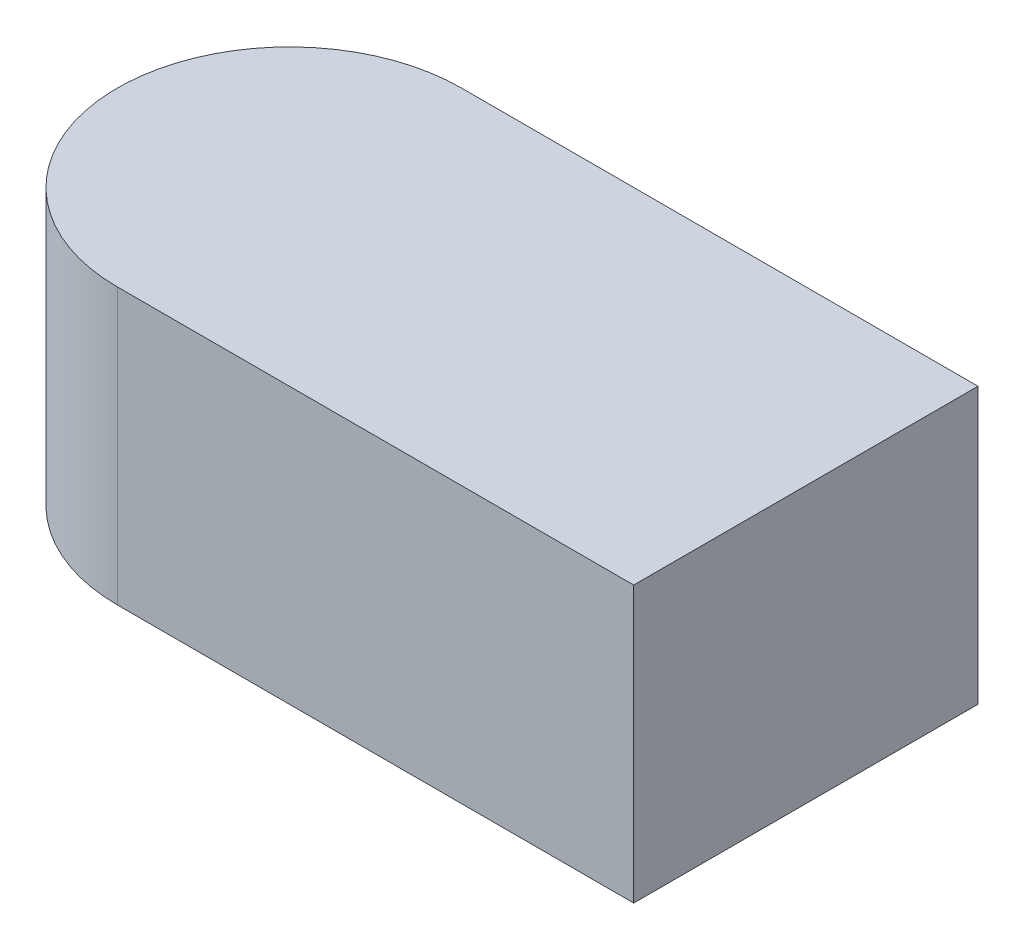
ISO-10303-21;
HEADER;
FILE_DESCRIPTION(('STEP AP214'),'2;1');
FILE_NAME('part.step','',(''),(''),'','','');
FILE_SCHEMA(('AUTOMOTIVE_DESIGN { 1 0 10303 214 1 1 1 1 }'));
ENDSEC;
DATA;
#1=APPLICATION_CONTEXT('core data for automotive mechanical design processes');
#2=APPLICATION_PROTOCOL_DEFINITION('international standard','automotive_design',2000,#1);
#3=PRODUCT_CONTEXT('',#1,'mechanical');
#4=PRODUCT('Part','Part','',(#3));
#5=PRODUCT_RELATED_PRODUCT_CATEGORY('part','',(#4));
#6=PRODUCT_DEFINITION_FORMATION('','',#4);
#7=PRODUCT_DEFINITION_CONTEXT('part definition',#1,'design');
#8=PRODUCT_DEFINITION('design','',#6,#7);
#9=PRODUCT_DEFINITION_SHAPE('','',#8);
#10=(LENGTH_UNIT() NAMED_UNIT(*) SI_UNIT(.MILLI.,.METRE.));
#11=(NAMED_UNIT(*) PLANE_ANGLE_UNIT() SI_UNIT($,.RADIAN.));
#12=(NAMED_UNIT(*) SI_UNIT($,.STERADIAN.) SOLID_ANGLE_UNIT());
#13=UNCERTAINTY_MEASURE_WITH_UNIT(LENGTH_MEASURE(1.E-05),#10,'distance_accuracy_value','');
#14=(GEOMETRIC_REPRESENTATION_CONTEXT(3) GLOBAL_UNCERTAINTY_ASSIGNED_CONTEXT((#13)) GLOBAL_UNIT_ASSIGNED_CONTEXT((#10,
#11,#12)) REPRESENTATION_CONTEXT('',''));
#15=CARTESIAN_POINT('',(0.,0.,0.));
#16=DIRECTION('',(0.,0.,1.));
#17=DIRECTION('',(1.,0.,0.));
#18=AXIS2_PLACEMENT_3D('',#15,#16,#17);
#19=CARTESIAN_POINT('',(0.,0.2,0.));
#20=DIRECTION('',(0.,-1.,0.));
#21=DIRECTION('',(0.,0.,-1.));
#22=AXIS2_PLACEMENT_3D('',#19,#20,#21);
#23=PLANE('',#22);
#24=CARTESIAN_POINT('',(2.125,0.2,-2.5));
#25=DIRECTION('',(0.,-1.,0.));
#26=DIRECTION('',(0.,0.,-1.));
#27=AXIS2_PLACEMENT_3D('',#24,#25,#26);
#28=CIRCLE('',#27,0.125);
#29=CARTESIAN_POINT('',(2.125,0.2,-2.375));
#30=VERTEX_POINT('',#29);
#31=CARTESIAN_POINT('',(2.125,0.2,-2.625));
#32=VERTEX_POINT('',#31);
#33=EDGE_CURVE('E20',#30,#32,#28,.T.);
#34=ORIENTED_EDGE('',*,*,#33,.F.);
#35=DIRECTION('',(-1.,0.,0.));
#36=VECTOR('',#35,1.);
#37=CARTESIAN_POINT('',(2.5,0.2,-2.375));
#38=LINE('',#37,#36);
#39=CARTESIAN_POINT('',(2.5,0.2,-2.375));
#40=VERTEX_POINT('',#39);
#41=EDGE_CURVE('E55',#30,#40,#38,.F.);
#42=ORIENTED_EDGE('',*,*,#41,.T.);
#43=DIRECTION('',(0.,0.,1.));
#44=VECTOR('',#43,1.);
#45=CARTESIAN_POINT('',(2.5,0.2,-2.625));
#46=LINE('',#45,#44);
#47=CARTESIAN_POINT('',(2.5,0.2,-2.625));
#48=VERTEX_POINT('',#47);
#49=EDGE_CURVE('E63',#40,#48,#46,.F.);
#50=ORIENTED_EDGE('',*,*,#49,.T.);
#51=DIRECTION('',(1.,0.,0.));
#52=VECTOR('',#51,1.);
#53=CARTESIAN_POINT('',(2.125,0.2,-2.625));
#54=LINE('',#53,#52);
#55=EDGE_CURVE('E59',#48,#32,#54,.F.);
#56=ORIENTED_EDGE('',*,*,#55,.T.);
#57=EDGE_LOOP('',(#34,#42,#50,#56));
#58=FACE_BOUND('',#57,.T.);
#59=ADVANCED_FACE('F17',(#58),#23,.F.);
#60=CARTESIAN_POINT('',(2.5,0.,-2.375));
#61=DIRECTION('',(0.,0.,-1.));
#62=DIRECTION('',(-1.,0.,0.));
#63=AXIS2_PLACEMENT_3D('',#60,#61,#62);
#64=PLANE('',#63);
#65=ORIENTED_EDGE('',*,*,#41,.F.);
#66=DIRECTION('',(0.,-1.,0.));
#67=VECTOR('',#66,1.);
#68=CARTESIAN_POINT('',(2.125,0.,-2.375));
#69=LINE('',#68,#67);
#70=CARTESIAN_POINT('',(2.125,0.,-2.375));
#71=VERTEX_POINT('',#70);
#72=EDGE_CURVE('E70',#71,#30,#69,.F.);
#73=ORIENTED_EDGE('',*,*,#72,.F.);
#74=DIRECTION('',(1.,0.,0.));
#75=VECTOR('',#74,1.);
#76=CARTESIAN_POINT('',(0.,0.,-2.375));
#77=LINE('',#76,#75);
#78=CARTESIAN_POINT('',(2.5,0.,-2.375));
#79=VERTEX_POINT('',#78);
#80=EDGE_CURVE('E84',#79,#71,#77,.F.);
#81=ORIENTED_EDGE('',*,*,#80,.F.);
#82=DIRECTION('',(0.,1.,0.));
#83=VECTOR('',#82,1.);
#84=CARTESIAN_POINT('',(2.5,0.,-2.375));
#85=LINE('',#84,#83);
#86=EDGE_CURVE('E74',#79,#40,#85,.T.);
#87=ORIENTED_EDGE('',*,*,#86,.T.);
#88=EDGE_LOOP('',(#65,#73,#81,#87));
#89=FACE_BOUND('',#88,.T.);
#90=ADVANCED_FACE('F105',(#89),#64,.F.);
#91=CARTESIAN_POINT('',(2.125,0.,-2.5));
#92=DIRECTION('',(0.,-1.,0.));
#93=DIRECTION('',(0.,0.,-1.));
#94=AXIS2_PLACEMENT_3D('',#91,#92,#93);
#95=CYLINDRICAL_SURFACE('',#94,0.125);
#96=DIRECTION('',(0.,1.,0.));
#97=VECTOR('',#96,1.);
#98=CARTESIAN_POINT('',(2.125,0.,-2.625));
#99=LINE('',#98,#97);
#100=CARTESIAN_POINT('',(2.125,0.,-2.625));
#101=VERTEX_POINT('',#100);
#102=EDGE_CURVE('E65',#32,#101,#99,.F.);
#103=ORIENTED_EDGE('',*,*,#102,.T.);
#104=CARTESIAN_POINT('',(2.125,0.,-2.5));
#105=DIRECTION('',(0.,-1.,0.));
#106=DIRECTION('',(0.,0.,-1.));
#107=AXIS2_PLACEMENT_3D('',#104,#105,#106);
#108=CIRCLE('',#107,0.125);
#109=EDGE_CURVE('E97',#71,#101,#108,.T.);
#110=ORIENTED_EDGE('',*,*,#109,.F.);
#111=ORIENTED_EDGE('',*,*,#72,.T.);
#112=ORIENTED_EDGE('',*,*,#33,.T.);
#113=EDGE_LOOP('',(#103,#110,#111,#112));
#114=FACE_BOUND('',#113,.T.);
#115=ADVANCED_FACE('F68',(#114),#95,.T.);
#116=CARTESIAN_POINT('',(2.125,0.,-2.625));
#117=DIRECTION('',(0.,0.,1.));
#118=DIRECTION('',(1.,0.,0.));
#119=AXIS2_PLACEMENT_3D('',#116,#117,#118);
#120=PLANE('',#119);
#121=ORIENTED_EDGE('',*,*,#55,.F.);
#122=DIRECTION('',(0.,1.,0.));
#123=VECTOR('',#122,1.);
#124=CARTESIAN_POINT('',(2.5,0.,-2.625));
#125=LINE('',#124,#123);
#126=CARTESIAN_POINT('',(2.5,0.,-2.625));
#127=VERTEX_POINT('',#126);
#128=EDGE_CURVE('E35',#48,#127,#125,.F.);
#129=ORIENTED_EDGE('',*,*,#128,.T.);
#130=DIRECTION('',(1.,0.,0.));
#131=VECTOR('',#130,1.);
#132=CARTESIAN_POINT('',(0.,0.,-2.625));
#133=LINE('',#132,#131);
#134=EDGE_CURVE('E26',#101,#127,#133,.T.);
#135=ORIENTED_EDGE('',*,*,#134,.F.);
#136=ORIENTED_EDGE('',*,*,#102,.F.);
#137=EDGE_LOOP('',(#121,#129,#135,#136));
#138=FACE_BOUND('',#137,.T.);
#139=ADVANCED_FACE('F71',(#138),#120,.F.);
#140=CARTESIAN_POINT('',(2.5,0.,-2.625));
#141=DIRECTION('',(-1.,0.,0.));
#142=DIRECTION('',(0.,0.,1.));
#143=AXIS2_PLACEMENT_3D('',#140,#141,#142);
#144=PLANE('',#143);
#145=ORIENTED_EDGE('',*,*,#49,.F.);
#146=ORIENTED_EDGE('',*,*,#86,.F.);
#147=DIRECTION('',(0.,0.,-1.));
#148=VECTOR('',#147,1.);
#149=CARTESIAN_POINT('',(2.5,0.,0.));
#150=LINE('',#149,#148);
#151=EDGE_CURVE('E11',#127,#79,#150,.F.);
#152=ORIENTED_EDGE('',*,*,#151,.F.);
#153=ORIENTED_EDGE('',*,*,#128,.F.);
#154=EDGE_LOOP('',(#145,#146,#152,#153));
#155=FACE_BOUND('',#154,.T.);
#156=ADVANCED_FACE('F107',(#155),#144,.F.);
#157=CARTESIAN_POINT('',(0.,0.,0.));
#158=DIRECTION('',(0.,-1.,0.));
#159=DIRECTION('',(0.,0.,-1.));
#160=AXIS2_PLACEMENT_3D('',#157,#158,#159);
#161=PLANE('',#160);
#162=ORIENTED_EDGE('',*,*,#134,.T.);
#163=ORIENTED_EDGE('',*,*,#151,.T.);
#164=ORIENTED_EDGE('',*,*,#80,.T.);
#165=ORIENTED_EDGE('',*,*,#109,.T.);
#166=EDGE_LOOP('',(#162,#163,#164,#165));
#167=FACE_BOUND('',#166,.T.);
#168=ADVANCED_FACE('F103',(#167),#161,.T.);
#169=CLOSED_SHELL('',(#59,#90,#115,#139,#156,#168));
#170=MANIFOLD_SOLID_BREP('B1',#169);
#171=ADVANCED_BREP_SHAPE_REPRESENTATION('',(#18,#170),#14);
#172=SHAPE_DEFINITION_REPRESENTATION(#9,#171);
ENDSEC;
END-ISO-10303-21;
